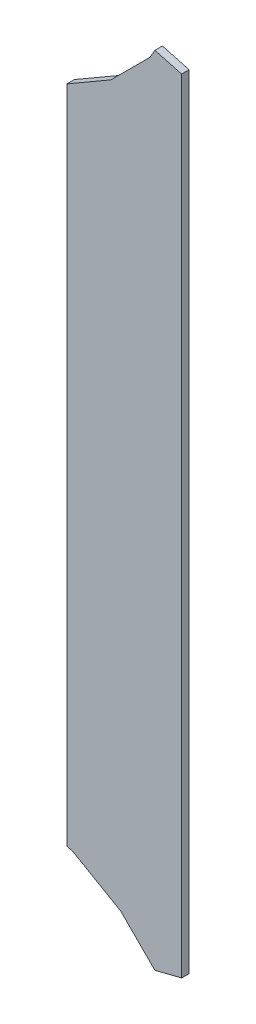
ISO-10303-21;
HEADER;
FILE_DESCRIPTION(('STEP AP214'),'2;1');
FILE_NAME('part.step','',(''),(''),'','','');
FILE_SCHEMA(('AUTOMOTIVE_DESIGN { 1 0 10303 214 1 1 1 1 }'));
ENDSEC;
DATA;
#1=APPLICATION_CONTEXT('core data for automotive mechanical design processes');
#2=APPLICATION_PROTOCOL_DEFINITION('international standard','automotive_design',2000,#1);
#3=PRODUCT_CONTEXT('',#1,'mechanical');
#4=PRODUCT('Part','Part','',(#3));
#5=PRODUCT_RELATED_PRODUCT_CATEGORY('part','',(#4));
#6=PRODUCT_DEFINITION_FORMATION('','',#4);
#7=PRODUCT_DEFINITION_CONTEXT('part definition',#1,'design');
#8=PRODUCT_DEFINITION('design','',#6,#7);
#9=PRODUCT_DEFINITION_SHAPE('','',#8);
#10=(LENGTH_UNIT() NAMED_UNIT(*) SI_UNIT(.MILLI.,.METRE.));
#11=(NAMED_UNIT(*) PLANE_ANGLE_UNIT() SI_UNIT($,.RADIAN.));
#12=(NAMED_UNIT(*) SI_UNIT($,.STERADIAN.) SOLID_ANGLE_UNIT());
#13=UNCERTAINTY_MEASURE_WITH_UNIT(LENGTH_MEASURE(1.E-05),#10,'distance_accuracy_value','');
#14=(GEOMETRIC_REPRESENTATION_CONTEXT(3) GLOBAL_UNCERTAINTY_ASSIGNED_CONTEXT((#13)) GLOBAL_UNIT_ASSIGNED_CONTEXT((#10,
#11,#12)) REPRESENTATION_CONTEXT('',''));
#15=CARTESIAN_POINT('',(0.,0.,0.));
#16=DIRECTION('',(0.,0.,1.));
#17=DIRECTION('',(1.,0.,0.));
#18=AXIS2_PLACEMENT_3D('',#15,#16,#17);
#19=CARTESIAN_POINT('',(89.7109985351562,92.0039978027344,0.));
#20=DIRECTION('',(0.862997392643225,-0.505208373140228,0.));
#21=DIRECTION('',(-0.505208373140228,-0.862997392643225,0.));
#22=AXIS2_PLACEMENT_3D('',#19,#20,#21);
#23=PLANE('',#22);
#24=DIRECTION('',(-0.505208373140228,-0.862997392643225,0.));
#25=VECTOR('',#24,1.);
#26=CARTESIAN_POINT('',(89.7109985351562,92.0039978027344,0.03556));
#27=LINE('',#26,#25);
#28=CARTESIAN_POINT('',(89.7109985351562,92.0039978027344,0.03556));
#29=VERTEX_POINT('',#28);
#30=CARTESIAN_POINT('',(89.6869964599609,91.9629974365234,0.03556));
#31=VERTEX_POINT('',#30);
#32=EDGE_CURVE('E11',#29,#31,#27,.T.);
#33=ORIENTED_EDGE('',*,*,#32,.F.);
#34=DIRECTION('',(0.,0.,1.));
#35=VECTOR('',#34,1.);
#36=CARTESIAN_POINT('',(89.7109985351562,92.0039978027344,0.));
#37=LINE('',#36,#35);
#38=CARTESIAN_POINT('',(89.7109985351562,92.0039978027344,0.));
#39=VERTEX_POINT('',#38);
#40=EDGE_CURVE('E24',#39,#29,#37,.T.);
#41=ORIENTED_EDGE('',*,*,#40,.F.);
#42=DIRECTION('',(-0.505208373140228,-0.862997392643225,0.));
#43=VECTOR('',#42,1.);
#44=CARTESIAN_POINT('',(89.7109985351562,92.0039978027344,0.));
#45=LINE('',#44,#43);
#46=CARTESIAN_POINT('',(89.6869964599609,91.9629974365234,0.));
#47=VERTEX_POINT('',#46);
#48=EDGE_CURVE('E112',#39,#47,#45,.T.);
#49=ORIENTED_EDGE('',*,*,#48,.T.);
#50=DIRECTION('',(0.,0.,1.));
#51=VECTOR('',#50,1.);
#52=CARTESIAN_POINT('',(89.6869964599609,91.9629974365234,0.));
#53=LINE('',#52,#51);
#54=EDGE_CURVE('E37',#47,#31,#53,.T.);
#55=ORIENTED_EDGE('',*,*,#54,.T.);
#56=EDGE_LOOP('',(#33,#41,#49,#55));
#57=FACE_BOUND('',#56,.T.);
#58=ADVANCED_FACE('F17',(#57),#23,.F.);
#59=CARTESIAN_POINT('',(89.6869964599609,91.9629974365234,0.));
#60=DIRECTION('',(0.707106781186548,-0.707106781186548,0.));
#61=DIRECTION('',(-0.707106781186548,-0.707106781186548,0.));
#62=AXIS2_PLACEMENT_3D('',#59,#60,#61);
#63=PLANE('',#62);
#64=DIRECTION('',(-0.707106781186548,-0.707106781186548,0.));
#65=VECTOR('',#64,1.);
#66=CARTESIAN_POINT('',(89.6869964599609,91.9629974365234,0.03556));
#67=LINE('',#66,#65);
#68=CARTESIAN_POINT('',(89.5019989013672,91.7779998779297,0.03556));
#69=VERTEX_POINT('',#68);
#70=EDGE_CURVE('E168',#31,#69,#67,.T.);
#71=ORIENTED_EDGE('',*,*,#70,.F.);
#72=ORIENTED_EDGE('',*,*,#54,.F.);
#73=DIRECTION('',(-0.707106781186548,-0.707106781186548,0.));
#74=VECTOR('',#73,1.);
#75=CARTESIAN_POINT('',(89.6869964599609,91.9629974365234,0.));
#76=LINE('',#75,#74);
#77=CARTESIAN_POINT('',(89.5019989013672,91.7779998779297,0.));
#78=VERTEX_POINT('',#77);
#79=EDGE_CURVE('E165',#47,#78,#76,.T.);
#80=ORIENTED_EDGE('',*,*,#79,.T.);
#81=DIRECTION('',(0.,0.,1.));
#82=VECTOR('',#81,1.);
#83=CARTESIAN_POINT('',(89.5019989013672,91.7779998779297,0.));
#84=LINE('',#83,#82);
#85=EDGE_CURVE('E163',#78,#69,#84,.T.);
#86=ORIENTED_EDGE('',*,*,#85,.T.);
#87=EDGE_LOOP('',(#71,#72,#80,#86));
#88=FACE_BOUND('',#87,.T.);
#89=ADVANCED_FACE('F176',(#88),#63,.F.);
#90=CARTESIAN_POINT('',(89.5019989013672,91.7779998779297,0.));
#91=DIRECTION('',(0.501043742409642,-0.86542195961978,0.));
#92=DIRECTION('',(-0.86542195961978,-0.501043742409642,0.));
#93=AXIS2_PLACEMENT_3D('',#90,#91,#92);
#94=PLANE('',#93);
#95=DIRECTION('',(-0.86542195961978,-0.501043742409642,0.));
#96=VECTOR('',#95,1.);
#97=CARTESIAN_POINT('',(89.5019989013672,91.7779998779297,0.03556));
#98=LINE('',#97,#96);
#99=CARTESIAN_POINT('',(89.2929992675781,91.6569976806641,0.03556));
#100=VERTEX_POINT('',#99);
#101=EDGE_CURVE('E160',#69,#100,#98,.T.);
#102=ORIENTED_EDGE('',*,*,#101,.F.);
#103=ORIENTED_EDGE('',*,*,#85,.F.);
#104=DIRECTION('',(-0.86542195961978,-0.501043742409642,0.));
#105=VECTOR('',#104,1.);
#106=CARTESIAN_POINT('',(89.5019989013672,91.7779998779297,0.));
#107=LINE('',#106,#105);
#108=CARTESIAN_POINT('',(89.2929992675781,91.6569976806641,0.));
#109=VERTEX_POINT('',#108);
#110=EDGE_CURVE('E157',#78,#109,#107,.T.);
#111=ORIENTED_EDGE('',*,*,#110,.T.);
#112=DIRECTION('',(0.,0.,1.));
#113=VECTOR('',#112,1.);
#114=CARTESIAN_POINT('',(89.2929992675781,91.6569976806641,0.));
#115=LINE('',#114,#113);
#116=EDGE_CURVE('E155',#109,#100,#115,.T.);
#117=ORIENTED_EDGE('',*,*,#116,.T.);
#118=EDGE_LOOP('',(#102,#103,#111,#117));
#119=FACE_BOUND('',#118,.T.);
#120=ADVANCED_FACE('F182',(#119),#94,.F.);
#121=CARTESIAN_POINT('',(89.2929992675781,91.6569976806641,0.));
#122=DIRECTION('',(1.,0.,0.));
#123=DIRECTION('',(0.,-1.,0.));
#124=AXIS2_PLACEMENT_3D('',#121,#122,#123);
#125=PLANE('',#124);
#126=DIRECTION('',(0.,-1.,0.));
#127=VECTOR('',#126,1.);
#128=CARTESIAN_POINT('',(89.2929992675781,91.6569976806641,0.03556));
#129=LINE('',#128,#127);
#130=CARTESIAN_POINT('',(89.2929992675781,88.5220031738281,0.03556));
#131=VERTEX_POINT('',#130);
#132=EDGE_CURVE('E152',#100,#131,#129,.T.);
#133=ORIENTED_EDGE('',*,*,#132,.F.);
#134=ORIENTED_EDGE('',*,*,#116,.F.);
#135=DIRECTION('',(0.,-1.,0.));
#136=VECTOR('',#135,1.);
#137=CARTESIAN_POINT('',(89.2929992675781,91.6569976806641,0.));
#138=LINE('',#137,#136);
#139=CARTESIAN_POINT('',(89.2929992675781,88.5220031738281,0.));
#140=VERTEX_POINT('',#139);
#141=EDGE_CURVE('E149',#109,#140,#138,.T.);
#142=ORIENTED_EDGE('',*,*,#141,.T.);
#143=DIRECTION('',(0.,0.,1.));
#144=VECTOR('',#143,1.);
#145=CARTESIAN_POINT('',(89.2929992675781,88.5220031738281,0.));
#146=LINE('',#145,#144);
#147=EDGE_CURVE('E147',#140,#131,#146,.T.);
#148=ORIENTED_EDGE('',*,*,#147,.T.);
#149=EDGE_LOOP('',(#133,#134,#142,#148));
#150=FACE_BOUND('',#149,.T.);
#151=ADVANCED_FACE('F184',(#150),#125,.F.);
#152=CARTESIAN_POINT('',(89.2929992675781,88.5220031738281,0.));
#153=DIRECTION('',(0.274824932681373,0.9614942830702,0.));
#154=DIRECTION('',(0.9614942830702,-0.274824932681373,0.));
#155=AXIS2_PLACEMENT_3D('',#152,#153,#154);
#156=PLANE('',#155);
#157=DIRECTION('',(0.9614942830702,-0.274824932681373,0.));
#158=VECTOR('',#157,1.);
#159=CARTESIAN_POINT('',(89.2929992675781,88.5220031738281,0.03556));
#160=LINE('',#159,#158);
#161=CARTESIAN_POINT('',(89.3209991455078,88.5139999389648,0.03556));
#162=VERTEX_POINT('',#161);
#163=EDGE_CURVE('E144',#131,#162,#160,.T.);
#164=ORIENTED_EDGE('',*,*,#163,.F.);
#165=ORIENTED_EDGE('',*,*,#147,.F.);
#166=DIRECTION('',(0.9614942830702,-0.274824932681373,0.));
#167=VECTOR('',#166,1.);
#168=CARTESIAN_POINT('',(89.2929992675781,88.5220031738281,0.));
#169=LINE('',#168,#167);
#170=CARTESIAN_POINT('',(89.3209991455078,88.5139999389648,0.));
#171=VERTEX_POINT('',#170);
#172=EDGE_CURVE('E141',#140,#171,#169,.T.);
#173=ORIENTED_EDGE('',*,*,#172,.T.);
#174=DIRECTION('',(0.,0.,1.));
#175=VECTOR('',#174,1.);
#176=CARTESIAN_POINT('',(89.3209991455078,88.5139999389648,0.));
#177=LINE('',#176,#175);
#178=EDGE_CURVE('E139',#171,#162,#177,.T.);
#179=ORIENTED_EDGE('',*,*,#178,.T.);
#180=EDGE_LOOP('',(#164,#165,#173,#179));
#181=FACE_BOUND('',#180,.T.);
#182=ADVANCED_FACE('F189',(#181),#156,.F.);
#183=CARTESIAN_POINT('',(89.3209991455078,88.5139999389648,0.));
#184=DIRECTION('',(0.499827454431494,0.866125000099023,0.));
#185=DIRECTION('',(0.866125000099023,-0.499827454431494,0.));
#186=AXIS2_PLACEMENT_3D('',#183,#184,#185);
#187=PLANE('',#186);
#188=DIRECTION('',(0.866125000099023,-0.499827454431494,0.));
#189=VECTOR('',#188,1.);
#190=CARTESIAN_POINT('',(89.3209991455078,88.5139999389648,0.03556));
#191=LINE('',#190,#189);
#192=CARTESIAN_POINT('',(89.5479965209961,88.3830032348633,0.03556));
#193=VERTEX_POINT('',#192);
#194=EDGE_CURVE('E136',#162,#193,#191,.T.);
#195=ORIENTED_EDGE('',*,*,#194,.F.);
#196=ORIENTED_EDGE('',*,*,#178,.F.);
#197=DIRECTION('',(0.866125000099023,-0.499827454431494,0.));
#198=VECTOR('',#197,1.);
#199=CARTESIAN_POINT('',(89.3209991455078,88.5139999389648,0.));
#200=LINE('',#199,#198);
#201=CARTESIAN_POINT('',(89.5479965209961,88.3830032348633,0.));
#202=VERTEX_POINT('',#201);
#203=EDGE_CURVE('E133',#171,#202,#200,.T.);
#204=ORIENTED_EDGE('',*,*,#203,.T.);
#205=DIRECTION('',(0.,0.,1.));
#206=VECTOR('',#205,1.);
#207=CARTESIAN_POINT('',(89.5479965209961,88.3830032348633,0.));
#208=LINE('',#207,#206);
#209=EDGE_CURVE('E131',#202,#193,#208,.T.);
#210=ORIENTED_EDGE('',*,*,#209,.T.);
#211=EDGE_LOOP('',(#195,#196,#204,#210));
#212=FACE_BOUND('',#211,.T.);
#213=ADVANCED_FACE('F192',(#212),#187,.F.);
#214=CARTESIAN_POINT('',(89.5479965209961,88.3830032348633,0.));
#215=DIRECTION('',(0.707106781186548,0.707106781186548,0.));
#216=DIRECTION('',(0.707106781186548,-0.707106781186548,0.));
#217=AXIS2_PLACEMENT_3D('',#214,#215,#216);
#218=PLANE('',#217);
#219=DIRECTION('',(0.707106781186548,-0.707106781186548,0.));
#220=VECTOR('',#219,1.);
#221=CARTESIAN_POINT('',(89.5479965209961,88.3830032348633,0.03556));
#222=LINE('',#221,#220);
#223=CARTESIAN_POINT('',(89.7109985351562,88.2200012207031,0.03556));
#224=VERTEX_POINT('',#223);
#225=EDGE_CURVE('E128',#193,#224,#222,.T.);
#226=ORIENTED_EDGE('',*,*,#225,.F.);
#227=ORIENTED_EDGE('',*,*,#209,.F.);
#228=DIRECTION('',(0.707106781186548,-0.707106781186548,0.));
#229=VECTOR('',#228,1.);
#230=CARTESIAN_POINT('',(89.5479965209961,88.3830032348633,0.));
#231=LINE('',#230,#229);
#232=CARTESIAN_POINT('',(89.7109985351562,88.2200012207031,0.));
#233=VERTEX_POINT('',#232);
#234=EDGE_CURVE('E125',#202,#233,#231,.T.);
#235=ORIENTED_EDGE('',*,*,#234,.T.);
#236=DIRECTION('',(0.,0.,1.));
#237=VECTOR('',#236,1.);
#238=CARTESIAN_POINT('',(89.7109985351562,88.2200012207031,0.));
#239=LINE('',#238,#237);
#240=EDGE_CURVE('E123',#233,#224,#239,.T.);
#241=ORIENTED_EDGE('',*,*,#240,.T.);
#242=EDGE_LOOP('',(#226,#227,#235,#241));
#243=FACE_BOUND('',#242,.T.);
#244=ADVANCED_FACE('F197',(#243),#218,.F.);
#245=CARTESIAN_POINT('',(89.7109985351562,88.2200012207031,0.));
#246=DIRECTION('',(-0.244317101719268,0.969695392279192,0.));
#247=DIRECTION('',(0.969695392279192,0.244317101719268,0.));
#248=AXIS2_PLACEMENT_3D('',#245,#246,#247);
#249=PLANE('',#248);
#250=DIRECTION('',(0.969695392279192,0.244317101719268,0.));
#251=VECTOR('',#250,1.);
#252=CARTESIAN_POINT('',(89.7109985351562,88.2200012207031,0.03556));
#253=LINE('',#252,#251);
#254=CARTESIAN_POINT('',(89.8379974365234,88.2519989013672,0.03556));
#255=VERTEX_POINT('',#254);
#256=EDGE_CURVE('E120',#224,#255,#253,.T.);
#257=ORIENTED_EDGE('',*,*,#256,.F.);
#258=ORIENTED_EDGE('',*,*,#240,.F.);
#259=DIRECTION('',(0.969695392279192,0.244317101719268,0.));
#260=VECTOR('',#259,1.);
#261=CARTESIAN_POINT('',(89.7109985351562,88.2200012207031,0.));
#262=LINE('',#261,#260);
#263=CARTESIAN_POINT('',(89.8379974365234,88.2519989013672,0.));
#264=VERTEX_POINT('',#263);
#265=EDGE_CURVE('E118',#233,#264,#262,.T.);
#266=ORIENTED_EDGE('',*,*,#265,.T.);
#267=DIRECTION('',(0.,0.,1.));
#268=VECTOR('',#267,1.);
#269=CARTESIAN_POINT('',(89.8379974365234,88.2519989013672,0.));
#270=LINE('',#269,#268);
#271=EDGE_CURVE('E103',#264,#255,#270,.T.);
#272=ORIENTED_EDGE('',*,*,#271,.T.);
#273=EDGE_LOOP('',(#257,#258,#266,#272));
#274=FACE_BOUND('',#273,.T.);
#275=ADVANCED_FACE('F199',(#274),#249,.F.);
#276=CARTESIAN_POINT('',(89.8379974365235,88.2519989013672,0.));
#277=DIRECTION('',(-1.,0.,0.));
#278=DIRECTION('',(0.,1.,0.));
#279=AXIS2_PLACEMENT_3D('',#276,#277,#278);
#280=PLANE('',#279);
#281=DIRECTION('',(0.,1.,0.));
#282=VECTOR('',#281,1.);
#283=CARTESIAN_POINT('',(89.8379974365234,88.2519989013672,0.03556));
#284=LINE('',#283,#282);
#285=CARTESIAN_POINT('',(89.8379974365234,91.9700012207031,0.03556));
#286=VERTEX_POINT('',#285);
#287=EDGE_CURVE('E107',#255,#286,#284,.T.);
#288=ORIENTED_EDGE('',*,*,#287,.F.);
#289=ORIENTED_EDGE('',*,*,#271,.F.);
#290=DIRECTION('',(0.,1.,0.));
#291=VECTOR('',#290,1.);
#292=CARTESIAN_POINT('',(89.8379974365234,88.2519989013672,0.));
#293=LINE('',#292,#291);
#294=CARTESIAN_POINT('',(89.8379974365234,91.9700012207031,0.));
#295=VERTEX_POINT('',#294);
#296=EDGE_CURVE('E99',#264,#295,#293,.T.);
#297=ORIENTED_EDGE('',*,*,#296,.T.);
#298=DIRECTION('',(0.,0.,1.));
#299=VECTOR('',#298,1.);
#300=CARTESIAN_POINT('',(89.8379974365234,91.9700012207031,0.));
#301=LINE('',#300,#299);
#302=EDGE_CURVE('E89',#295,#286,#301,.T.);
#303=ORIENTED_EDGE('',*,*,#302,.T.);
#304=EDGE_LOOP('',(#288,#289,#297,#303));
#305=FACE_BOUND('',#304,.T.);
#306=ADVANCED_FACE('F102',(#305),#280,.F.);
#307=CARTESIAN_POINT('',(89.8379974365235,91.9700012207031,0.));
#308=DIRECTION('',(-0.258587179631702,-0.965987924629559,0.));
#309=DIRECTION('',(-0.965987924629559,0.258587179631702,0.));
#310=AXIS2_PLACEMENT_3D('',#307,#308,#309);
#311=PLANE('',#310);
#312=DIRECTION('',(-0.965987924629559,0.258587179631702,0.));
#313=VECTOR('',#312,1.);
#314=CARTESIAN_POINT('',(89.8379974365234,91.9700012207031,0.03556));
#315=LINE('',#314,#313);
#316=EDGE_CURVE('E95',#286,#29,#315,.T.);
#317=ORIENTED_EDGE('',*,*,#316,.F.);
#318=ORIENTED_EDGE('',*,*,#302,.F.);
#319=DIRECTION('',(-0.965987924629559,0.258587179631702,0.));
#320=VECTOR('',#319,1.);
#321=CARTESIAN_POINT('',(89.8379974365234,91.9700012207031,0.));
#322=LINE('',#321,#320);
#323=EDGE_CURVE('E93',#295,#39,#322,.T.);
#324=ORIENTED_EDGE('',*,*,#323,.T.);
#325=ORIENTED_EDGE('',*,*,#40,.T.);
#326=EDGE_LOOP('',(#317,#318,#324,#325));
#327=FACE_BOUND('',#326,.T.);
#328=ADVANCED_FACE('F91',(#327),#311,.F.);
#329=CARTESIAN_POINT('',(89.7109985351562,92.0039978027344,0.));
#330=DIRECTION('',(0.,0.,1.));
#331=DIRECTION('',(1.,0.,0.));
#332=AXIS2_PLACEMENT_3D('',#329,#330,#331);
#333=PLANE('',#332);
#334=ORIENTED_EDGE('',*,*,#323,.F.);
#335=ORIENTED_EDGE('',*,*,#296,.F.);
#336=ORIENTED_EDGE('',*,*,#265,.F.);
#337=ORIENTED_EDGE('',*,*,#234,.F.);
#338=ORIENTED_EDGE('',*,*,#203,.F.);
#339=ORIENTED_EDGE('',*,*,#172,.F.);
#340=ORIENTED_EDGE('',*,*,#141,.F.);
#341=ORIENTED_EDGE('',*,*,#110,.F.);
#342=ORIENTED_EDGE('',*,*,#79,.F.);
#343=ORIENTED_EDGE('',*,*,#48,.F.);
#344=EDGE_LOOP('',(#334,#335,#336,#337,#338,#339,#340,#341,#342,#343));
#345=FACE_BOUND('',#344,.T.);
#346=ADVANCED_FACE('F110',(#345),#333,.F.);
#347=CARTESIAN_POINT('',(89.7109985351562,92.0039978027344,0.03556));
#348=DIRECTION('',(0.,0.,1.));
#349=DIRECTION('',(1.,0.,0.));
#350=AXIS2_PLACEMENT_3D('',#347,#348,#349);
#351=PLANE('',#350);
#352=ORIENTED_EDGE('',*,*,#32,.T.);
#353=ORIENTED_EDGE('',*,*,#70,.T.);
#354=ORIENTED_EDGE('',*,*,#101,.T.);
#355=ORIENTED_EDGE('',*,*,#132,.T.);
#356=ORIENTED_EDGE('',*,*,#163,.T.);
#357=ORIENTED_EDGE('',*,*,#194,.T.);
#358=ORIENTED_EDGE('',*,*,#225,.T.);
#359=ORIENTED_EDGE('',*,*,#256,.T.);
#360=ORIENTED_EDGE('',*,*,#287,.T.);
#361=ORIENTED_EDGE('',*,*,#316,.T.);
#362=EDGE_LOOP('',(#352,#353,#354,#355,#356,#357,#358,#359,#360,#361));
#363=FACE_BOUND('',#362,.T.);
#364=ADVANCED_FACE('F179',(#363),#351,.T.);
#365=CLOSED_SHELL('',(#58,#89,#120,#151,#182,#213,#244,#275,#306,#328,#346,#364));
#366=MANIFOLD_SOLID_BREP('B1',#365);
#367=ADVANCED_BREP_SHAPE_REPRESENTATION('',(#18,#366),#14);
#368=SHAPE_DEFINITION_REPRESENTATION(#9,#367);
ENDSEC;
END-ISO-10303-21;
